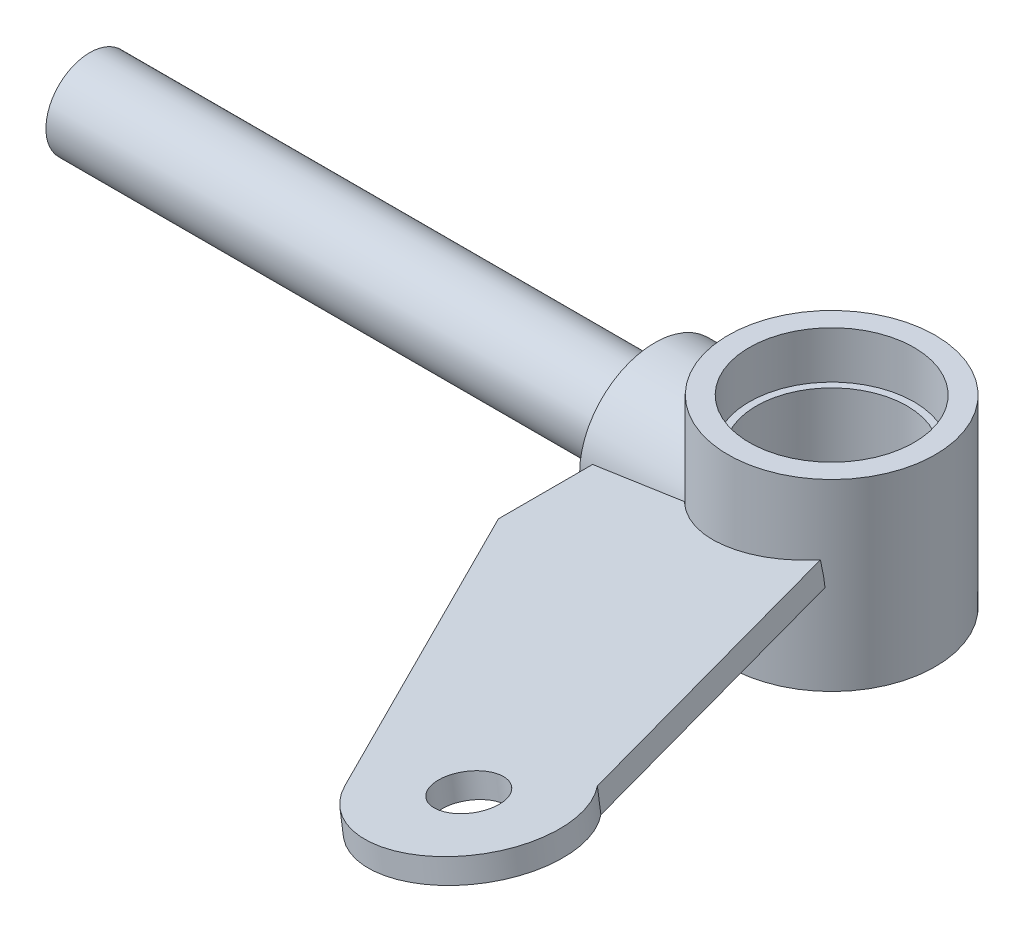
ISO-10303-21;
HEADER;
FILE_DESCRIPTION(('STEP AP214'),'2;1');
FILE_NAME('part.step','',(''),(''),'','','');
FILE_SCHEMA(('AUTOMOTIVE_DESIGN { 1 0 10303 214 1 1 1 1 }'));
ENDSEC;
DATA;
#1=APPLICATION_CONTEXT('core data for automotive mechanical design processes');
#2=APPLICATION_PROTOCOL_DEFINITION('international standard','automotive_design',2000,#1);
#3=PRODUCT_CONTEXT('',#1,'mechanical');
#4=PRODUCT('Part','Part','',(#3));
#5=PRODUCT_RELATED_PRODUCT_CATEGORY('part','',(#4));
#6=PRODUCT_DEFINITION_FORMATION('','',#4);
#7=PRODUCT_DEFINITION_CONTEXT('part definition',#1,'design');
#8=PRODUCT_DEFINITION('design','',#6,#7);
#9=PRODUCT_DEFINITION_SHAPE('','',#8);
#10=(LENGTH_UNIT() NAMED_UNIT(*) SI_UNIT(.MILLI.,.METRE.));
#11=(NAMED_UNIT(*) PLANE_ANGLE_UNIT() SI_UNIT($,.RADIAN.));
#12=(NAMED_UNIT(*) SI_UNIT($,.STERADIAN.) SOLID_ANGLE_UNIT());
#13=UNCERTAINTY_MEASURE_WITH_UNIT(LENGTH_MEASURE(1.E-05),#10,'distance_accuracy_value','');
#14=(GEOMETRIC_REPRESENTATION_CONTEXT(3) GLOBAL_UNCERTAINTY_ASSIGNED_CONTEXT((#13)) GLOBAL_UNIT_ASSIGNED_CONTEXT((#10,
#11,#12)) REPRESENTATION_CONTEXT('',''));
#15=CARTESIAN_POINT('',(0.,0.,0.));
#16=DIRECTION('',(0.,0.,1.));
#17=DIRECTION('',(1.,0.,0.));
#18=AXIS2_PLACEMENT_3D('',#15,#16,#17);
#19=CARTESIAN_POINT('',(-23.8649527829231,-3.56664109055751,0.));
#20=DIRECTION('',(1.,0.,0.));
#21=DIRECTION('',(0.,0.,-1.));
#22=AXIS2_PLACEMENT_3D('',#19,#20,#21);
#23=CYLINDRICAL_SURFACE('',#22,10.1308937353786);
#24=CARTESIAN_POINT('',(-23.8649527829231,-3.56664109055751,0.));
#25=DIRECTION('',(-1.,0.,0.));
#26=DIRECTION('',(0.,0.,1.));
#27=AXIS2_PLACEMENT_3D('',#24,#25,#26);
#28=CIRCLE('',#27,10.1308937353786);
#29=CARTESIAN_POINT('',(-23.8649527829231,-3.56664109055751,10.1308937353786));
#30=VERTEX_POINT('',#29);
#31=EDGE_CURVE('E46',#30,#30,#28,.T.);
#32=ORIENTED_EDGE('',*,*,#31,.F.);
#33=EDGE_LOOP('',(#32));
#34=FACE_BOUND('',#33,.T.);
#35=CARTESIAN_POINT('',(-9.61903800400362,-3.56664109055751,10.1308937353786));
#36=CARTESIAN_POINT('',(-9.61904039518556,-3.80639849007304,10.1308925484275));
#37=CARTESIAN_POINT('',(-9.62804826640795,-4.04617130452357,10.1223617673847));
#38=CARTESIAN_POINT('',(-9.66356299897845,-4.52332005065299,10.088460451511));
#39=CARTESIAN_POINT('',(-9.69007987684676,-4.76069453133077,10.0630802774652));
#40=CARTESIAN_POINT('',(-9.75923055949351,-5.23127763039902,9.99603045747903));
#41=CARTESIAN_POINT('',(-9.8019015506235,-5.46447532682341,9.95432321945606));
#42=CARTESIAN_POINT('',(-9.90128180737341,-5.92461065115534,9.85547651706718));
#43=CARTESIAN_POINT('',(-9.95799916585496,-6.15154458610549,9.79832815451211));
#44=CARTESIAN_POINT('',(-10.0822680357526,-6.59500296099345,9.67039785709462));
#45=CARTESIAN_POINT('',(-10.1496678308784,-6.81162484133087,9.59980439757005));
#46=CARTESIAN_POINT('',(-10.2935220507789,-7.23689009378552,9.44539414340223));
#47=CARTESIAN_POINT('',(-10.3699756105002,-7.4455342256309,9.36157861182483));
#48=CARTESIAN_POINT('',(-10.6096718629706,-8.05899105580503,9.09139352136984));
#49=CARTESIAN_POINT('',(-10.7833486402566,-8.45165774662793,8.8861885255637));
#50=CARTESIAN_POINT('',(-11.0707297974541,-9.05057278524142,8.52232525593784));
#51=CARTESIAN_POINT('',(-11.1803271124111,-9.26806242968694,8.37833864467592));
#52=CARTESIAN_POINT('',(-11.4016441573872,-9.6906947076907,8.07456910940664));
#53=CARTESIAN_POINT('',(-11.5133640558991,-9.89583635561965,7.91478492710445));
#54=CARTESIAN_POINT('',(-11.7367057479711,-10.2935623005356,7.5796609888092));
#55=CARTESIAN_POINT('',(-11.8483272309982,-10.4861301228153,7.40430150800249));
#56=CARTESIAN_POINT('',(-12.0692087650288,-10.8578860164378,7.03851926498492));
#57=CARTESIAN_POINT('',(-12.1784686367169,-11.0370730743084,6.84809536402509));
#58=CARTESIAN_POINT('',(-12.4124255960368,-11.4131649892626,6.41588768798282));
#59=CARTESIAN_POINT('',(-12.5362378994176,-11.6072125319033,6.17112054980703));
#60=CARTESIAN_POINT('',(-12.7744549755405,-11.9737930574009,5.6615641072247));
#61=CARTESIAN_POINT('',(-12.8888578281117,-12.1463216526137,5.39677073715651));
#62=CARTESIAN_POINT('',(-13.1048393114109,-12.4674846211503,4.84877997013028));
#63=CARTESIAN_POINT('',(-13.2064401679256,-12.6161605317473,4.5656157993196));
#64=CARTESIAN_POINT('',(-13.3939004205756,-12.8876020711898,3.98221905452536));
#65=CARTESIAN_POINT('',(-13.4797673764695,-13.0103801476271,3.68199476884057));
#66=CARTESIAN_POINT('',(-13.6110115594488,-13.1966336019867,3.15477503796826));
#67=CARTESIAN_POINT('',(-13.6609505125659,-13.2670334245227,2.93133323530667));
#68=CARTESIAN_POINT('',(-13.7503758553478,-13.392570600585,2.47817568608819));
#69=CARTESIAN_POINT('',(-13.7898645953643,-13.4477113861407,2.24846136312407));
#70=CARTESIAN_POINT('',(-13.8575683254481,-13.5419798008082,1.78428620306748));
#71=CARTESIAN_POINT('',(-13.885790634778,-13.581117826552,1.54982855186427));
#72=CARTESIAN_POINT('',(-13.9303943769411,-13.6428731553088,1.0776134348273));
#73=CARTESIAN_POINT('',(-13.9467753963032,-13.6654898814359,0.83985585406291));
#74=CARTESIAN_POINT('',(-13.9673520552707,-13.6938878916493,0.362262652436662));
#75=CARTESIAN_POINT('',(-13.9715198427555,-13.6996306950487,0.122423530875538));
#76=CARTESIAN_POINT('',(-13.9674958248509,-13.6940815897164,-0.356951834590658));
#77=CARTESIAN_POINT('',(-13.9593040668533,-13.682789746303,-0.596488079653567));
#78=CARTESIAN_POINT('',(-13.9307443343899,-13.6433434302408,-1.0734820401737));
#79=CARTESIAN_POINT('',(-13.9103736947184,-13.6151852665927,-1.31093928912264));
#80=CARTESIAN_POINT('',(-13.8579058877799,-13.5424266781346,-1.78199605263438));
#81=CARTESIAN_POINT('',(-13.8258087529768,-13.4978262988436,-2.01559557787515));
#82=CARTESIAN_POINT('',(-13.7516546264907,-13.3943252629383,-2.47073456285516));
#83=CARTESIAN_POINT('',(-13.7099106900111,-13.3358728600535,-2.69242764401209));
#84=CARTESIAN_POINT('',(-13.6167803089116,-13.2047397005971,-3.12956162592222));
#85=CARTESIAN_POINT('',(-13.5653904956596,-13.132053972933,-3.34500031200948));
#86=CARTESIAN_POINT('',(-13.4539013909604,-12.9732751607129,-3.76847042647945));
#87=CARTESIAN_POINT('',(-13.3938044220822,-12.8871856510606,-3.97650381179523));
#88=CARTESIAN_POINT('',(-13.2658556463471,-12.702366642786,-4.38448447000792));
#89=CARTESIAN_POINT('',(-13.1980010299463,-12.6036325631847,-4.58442877760948));
#90=CARTESIAN_POINT('',(-13.0477251760939,-12.3827907472346,-4.99711503805583));
#91=CARTESIAN_POINT('',(-12.9645227706009,-12.2593060849262,-5.20883565069022));
#92=CARTESIAN_POINT('',(-12.7912655651893,-11.9987261472283,-5.62089044097815));
#93=CARTESIAN_POINT('',(-12.7012078641698,-11.861625101942,-5.82121973456842));
#94=CARTESIAN_POINT('',(-12.5156831813874,-11.5746637198013,-6.21007304769013));
#95=CARTESIAN_POINT('',(-12.4202129330681,-11.4247956498306,-6.39858979053965));
#96=CARTESIAN_POINT('',(-12.2254037176577,-11.1131238721971,-6.76336978651223));
#97=CARTESIAN_POINT('',(-12.1260643094612,-10.9513188017592,-6.93963163609262));
#98=CARTESIAN_POINT('',(-11.9060924564752,-10.5847977195688,-7.31169885898195));
#99=CARTESIAN_POINT('',(-11.784977050915,-10.3777434401458,-7.50492223431334));
#100=CARTESIAN_POINT('',(-11.5421499086569,-9.94838845974052,-7.87326842070626));
#101=CARTESIAN_POINT('',(-11.4204380574974,-9.72608471665142,-8.04838760260167));
#102=CARTESIAN_POINT('',(-11.1793564225601,-9.26667224415712,-8.38002952893089));
#103=CARTESIAN_POINT('',(-11.059987157159,-9.02956028541537,-8.53654819525791));
#104=CARTESIAN_POINT('',(-10.8270403738253,-8.54107815226735,-8.83013329096768));
#105=CARTESIAN_POINT('',(-10.7134613267578,-8.28971177973054,-8.96720487334647));
#106=CARTESIAN_POINT('',(-10.4345578564576,-7.62721997990816,-9.29241023498748));
#107=CARTESIAN_POINT('',(-10.276013055899,-7.20568192841436,-9.46596501358648));
#108=CARTESIAN_POINT('',(-10.0690586595743,-6.55040855821285,-9.68427081004709));
#109=CARTESIAN_POINT('',(-10.0052475501124,-6.32830056588317,-9.7500073736609));
#110=CARTESIAN_POINT('',(-9.89019913814885,-5.87698619457917,-9.86668962366791));
#111=CARTESIAN_POINT('',(-9.83895932371261,-5.64778124400931,-9.91763826528416));
#112=CARTESIAN_POINT('',(-9.75837597016585,-5.22091458018934,-9.99688268890805));
#113=CARTESIAN_POINT('',(-9.72683786447325,-5.0240958262901,-10.0275019956832));
#114=CARTESIAN_POINT('',(-9.67536667327016,-4.62751365762141,-10.077175547512));
#115=CARTESIAN_POINT('',(-9.65543122849678,-4.42775084996649,-10.0962321437387));
#116=CARTESIAN_POINT('',(-9.62795797837324,-4.02671672226621,-10.1224349906279));
#117=CARTESIAN_POINT('',(-9.6204122799653,-3.82544644474953,-10.1295888241474));
#118=CARTESIAN_POINT('',(-9.61800696449502,-3.42275529878834,-10.1318727471276));
#119=CARTESIAN_POINT('',(-9.62314764588194,-3.2213344269125,-10.1270025537211));
#120=CARTESIAN_POINT('',(-9.64588409227045,-2.82015303979755,-10.1053481719863));
#121=CARTESIAN_POINT('',(-9.66346131474361,-2.62039050009428,-10.0885817205352));
#122=CARTESIAN_POINT('',(-9.7103475014837,-2.22359057700764,-10.0434606985891));
#123=CARTESIAN_POINT('',(-9.73965643283577,-2.02655318598011,-10.0151061606061));
#124=CARTESIAN_POINT('',(-9.80896813642319,-1.6361160617716,-9.94723031172033));
#125=CARTESIAN_POINT('',(-9.84898244301011,-1.44272049442085,-9.90769695372883));
#126=CARTESIAN_POINT('',(-9.93840382129691,-1.06054152358299,-9.81799555196965));
#127=CARTESIAN_POINT('',(-9.987816225101,-0.871760807328803,-9.76782146921264));
#128=CARTESIAN_POINT('',(-10.116329852951,-0.423853421042503,-9.63495869026011));
#129=CARTESIAN_POINT('',(-10.1993379012841,-0.167299199204759,-9.54734104960247));
#130=CARTESIAN_POINT('',(-10.3772942193556,0.334306117510249,-9.35360629636579));
#131=CARTESIAN_POINT('',(-10.4722424118898,0.5793572867514,-9.24748930340058));
#132=CARTESIAN_POINT('',(-10.6707826742691,1.05799001089977,-9.01767125631354));
#133=CARTESIAN_POINT('',(-10.7743900143872,1.2915500983756,-8.89393885548554));
#134=CARTESIAN_POINT('',(-10.9870097338924,1.74644839226086,-8.6299043590512));
#135=CARTESIAN_POINT('',(-11.0960215550136,1.96778785605096,-8.48960397280577));
#136=CARTESIAN_POINT('',(-11.3200061370829,2.40435294955986,-8.18868526639421));
#137=CARTESIAN_POINT('',(-11.4350599663479,2.61920935204989,-8.02759203023276));
#138=CARTESIAN_POINT('',(-11.6654520160729,3.03539669583716,-7.68895804136308));
#139=CARTESIAN_POINT('',(-11.7807902494431,3.23672701096218,-7.51141652810762));
#140=CARTESIAN_POINT('',(-12.0092582989231,3.62509143227999,-7.14044990952776));
#141=CARTESIAN_POINT('',(-12.1223902014477,3.81213958654222,-6.9470408106314));
#142=CARTESIAN_POINT('',(-12.3443764724911,4.17142654750338,-6.54447239318099));
#143=CARTESIAN_POINT('',(-12.4532294070762,4.34366041234396,-6.33530786212548));
#144=CARTESIAN_POINT('',(-12.6592105315339,4.66403356177297,-5.91251250663103));
#145=CARTESIAN_POINT('',(-12.756652573291,4.81294498034245,-5.69962055304822));
#146=CARTESIAN_POINT('',(-12.9438341974239,5.09523556233258,-5.26069786253675));
#147=CARTESIAN_POINT('',(-13.0335775948145,5.2286224306741,-5.03467372741163));
#148=CARTESIAN_POINT('',(-13.203639574756,5.47872307569743,-4.5701185779084));
#149=CARTESIAN_POINT('',(-13.2839569590916,5.59543473306986,-4.33158597904411));
#150=CARTESIAN_POINT('',(-13.4334147586671,5.81081876001885,-3.84310964191962));
#151=CARTESIAN_POINT('',(-13.5025552563403,5.90949126264096,-3.59316598783722));
#152=CARTESIAN_POINT('',(-13.6285500984672,6.0881781687157,-3.08116744840382));
#153=CARTESIAN_POINT('',(-13.685296248588,6.16802871246312,-2.8190283988032));
#154=CARTESIAN_POINT('',(-13.7842662640073,6.30667972615402,-2.28653086208386));
#155=CARTESIAN_POINT('',(-13.8264899456796,6.36547992993113,-2.01617227108185));
#156=CARTESIAN_POINT('',(-13.8951876887182,6.46089325607901,-1.46982675384622));
#157=CARTESIAN_POINT('',(-13.92167543574,6.49752565846372,-1.19384493490776));
#158=CARTESIAN_POINT('',(-13.9581604686139,6.54793547020552,-0.638735201978681));
#159=CARTESIAN_POINT('',(-13.9681603176359,6.56171643199589,-0.359607783789694));
#160=CARTESIAN_POINT('',(-13.9711500360893,6.56583795252878,0.159413192084087));
#161=CARTESIAN_POINT('',(-13.9663437645275,6.55921549763676,0.399277514995647));
#162=CARTESIAN_POINT('',(-13.9444750988441,6.52903147048661,0.877354922388121));
#163=CARTESIAN_POINT('',(-13.9274140752457,6.50547179242046,1.11556818850916));
#164=CARTESIAN_POINT('',(-13.8814170008217,6.44177184925209,1.58859789337555));
#165=CARTESIAN_POINT('',(-13.8524806813183,6.40163120900632,1.82341425514167));
#166=CARTESIAN_POINT('',(-13.7833558826398,6.30534603610142,2.28804988925621));
#167=CARTESIAN_POINT('',(-13.7431670481229,6.24920099804036,2.51786900355014));
#168=CARTESIAN_POINT('',(-13.653222476376,6.12286458200034,2.96678777092026));
#169=CARTESIAN_POINT('',(-13.6036632807597,6.05296073537101,3.18600817588901));
#170=CARTESIAN_POINT('',(-13.4953977759985,5.89923694826681,3.61726235028896));
#171=CARTESIAN_POINT('',(-13.4366882895127,5.81541217323288,3.82929359210396));
#172=CARTESIAN_POINT('',(-13.3111546937625,5.63472663802529,4.24514110928424));
#173=CARTESIAN_POINT('',(-13.2443330727005,5.53786987411879,4.44895987820896));
#174=CARTESIAN_POINT('',(-13.1035931875214,5.33189351278721,4.84783428956793));
#175=CARTESIAN_POINT('',(-13.0296723876691,5.22276953127871,5.0428867640026));
#176=CARTESIAN_POINT('',(-12.8655887953336,4.97776246672566,5.44900506020993));
#177=CARTESIAN_POINT('',(-12.774573934779,4.84025107136051,5.65874481038786));
#178=CARTESIAN_POINT('',(-12.5864152819499,4.55148431377991,6.06575202179333));
#179=CARTESIAN_POINT('',(-12.4892688484989,4.40022301627013,6.26301403396537));
#180=CARTESIAN_POINT('',(-12.2903857682433,4.08468018068767,6.64482533350065));
#181=CARTESIAN_POINT('',(-12.1886436622751,3.92038297231731,6.82935880653214));
#182=CARTESIAN_POINT('',(-11.9823876861637,3.57969358465794,7.18509243328137));
#183=CARTESIAN_POINT('',(-11.8778745980929,3.40330479623322,7.35629629651572));
#184=CARTESIAN_POINT('',(-11.647935575154,3.00449779613303,7.71623517005945));
#185=CARTESIAN_POINT('',(-11.5222871992665,2.77967722820198,7.90217618090308));
#186=CARTESIAN_POINT('',(-11.2726129564929,2.31421952225714,8.25443630149153));
#187=CARTESIAN_POINT('',(-11.1485875112876,2.07357836777106,8.42075039824053));
#188=CARTESIAN_POINT('',(-10.9057722570196,1.57697996999549,8.73293186636326));
#189=CARTESIAN_POINT('',(-10.7869801360365,1.32102961008681,8.87880832982476));
#190=CARTESIAN_POINT('',(-10.5587418575411,0.794270740970725,9.14905212486612));
#191=CARTESIAN_POINT('',(-10.4492914539145,0.523469075096433,9.27342925523371));
#192=CARTESIAN_POINT('',(-10.2020195511406,-0.147807927528755,9.54599963851673));
#193=CARTESIAN_POINT('',(-10.0711059209067,-0.555714314304154,9.68286968729264));
#194=CARTESIAN_POINT('',(-9.90733587456377,-1.18537456282063,9.84945002462021));
#195=CARTESIAN_POINT('',(-9.85821569931913,-1.39798272775063,9.89848970747908));
#196=CARTESIAN_POINT('',(-9.77257407853592,-1.82833914504426,9.98305180029197));
#197=CARTESIAN_POINT('',(-9.73604673290652,-2.04608493905188,10.0185805413043));
#198=CARTESIAN_POINT('',(-9.67788393172438,-2.48006028989114,10.0747739941289));
#199=CARTESIAN_POINT('',(-9.65591215394802,-2.69620084434266,10.0957749346338));
#200=CARTESIAN_POINT('',(-9.62648626113937,-3.13043672258906,10.1238371131521));
#201=CARTESIAN_POINT('',(-9.61903582873288,-3.34853252815357,10.1308948151543));
#202=CARTESIAN_POINT('',(-9.61903800400362,-3.56664109055751,10.1308937353786));
#203=B_SPLINE_CURVE_WITH_KNOTS('',3,(#35,#36,#37,#38,#39,#40,#41,#42,#43,#44,#45,#46,#47,#48,
#49,#50,#51,#52,#53,#54,#55,#56,#57,#58,#59,#60,#61,#62,#63,#64,#65,#66,#67,#68,#69,#70,#71,#72,
#73,#74,#75,#76,#77,#78,#79,#80,#81,#82,#83,#84,#85,#86,#87,#88,#89,#90,#91,#92,#93,#94,#95,#96,
#97,#98,#99,#100,#101,#102,#103,#104,#105,#106,#107,#108,#109,#110,#111,#112,#113,#114,#115,
#116,#117,#118,#119,#120,#121,#122,#123,#124,#125,#126,#127,#128,#129,#130,#131,#132,#133,#134,
#135,#136,#137,#138,#139,#140,#141,#142,#143,#144,#145,#146,#147,#148,#149,#150,#151,#152,#153,
#154,#155,#156,#157,#158,#159,#160,#161,#162,#163,#164,#165,#166,#167,#168,#169,#170,#171,#172,
#173,#174,#175,#176,#177,#178,#179,#180,#181,#182,#183,#184,#185,#186,#187,#188,#189,#190,#191,
#192,#193,#194,#195,#196,#197,#198,#199,#200,#201,#202),.UNSPECIFIED.,.T.,.F.,(4,2,2,2,2,2,2,2,
2,2,2,2,2,2,2,2,2,2,2,2,2,2,2,2,2,2,2,2,2,2,2,2,2,2,2,2,2,2,2,2,2,2,2,2,2,2,2,2,2,2,2,2,2,2,2,2,
2,2,2,2,2,2,2,2,2,2,2,2,2,2,2,2,2,2,2,2,2,2,2,2,2,2,2,4),(0.,0.718986430556499,1.43838453432068,
2.15944884422623,2.88092956821217,3.59295563755625,4.30491373027604,5.72776731350085,
6.57598137740762,7.42426305706003,8.27363476416962,9.12307073841017,10.1296948523243,
11.1365238792831,12.1415801146481,13.1461521712457,13.8640302461093,14.5817467259189,
15.2989961777896,16.0162706731741,16.7351796358586,17.4540858419387,18.1731494298417,
18.8922110270861,19.5905886992465,20.2892107213434,20.9876467331289,21.6863364996942,
22.4621002275026,23.2381940966427,24.0147614424422,24.7914175818404,25.714522601662,
26.6378123097394,27.5613040742839,28.4845506775028,29.9265069423248,30.6465965896972,
31.3665422348896,31.9709148179918,32.5751644661552,33.1790290192293,33.782907778455,
34.3858880638182,34.9888666574522,35.5924975564188,36.1964719585592,37.0457694927818,
37.8950615357868,38.7458842406101,39.5966192404727,40.4722840821963,41.3479894337663,
42.2228220302062,43.0979453368963,43.9295666705423,44.7607734897943,45.5920858561592,
46.4233920910355,47.2616882272785,48.0999949627971,48.9375715455123,49.7750179082545,
50.4941329360237,51.213167553324,51.9322184396432,52.6512920353434,53.3566862334085,
54.0623259200509,54.7677497129391,55.4734264179514,56.2730674837934,57.0730553775135,
57.8740199357032,58.6747607895957,59.6267026398152,60.5788871058234,61.5306466193494,
62.4819711974511,63.8255216151532,64.4958132474092,65.1657904012277,65.8196903157807,
66.4737560383548),.UNSPECIFIED.);
#204=CARTESIAN_POINT('',(-9.61903800400362,-3.56664109055751,10.1308937353786));
#205=VERTEX_POINT('',#204);
#206=EDGE_CURVE('E54',#205,#205,#203,.T.);
#207=ORIENTED_EDGE('',*,*,#206,.F.);
#208=EDGE_LOOP('',(#207));
#209=FACE_BOUND('',#208,.T.);
#210=ADVANCED_FACE('F43',(#34,#209),#23,.T.);
#211=CARTESIAN_POINT('',(-23.8649527829231,-3.56664109055751,0.));
#212=DIRECTION('',(-1.,0.,0.));
#213=DIRECTION('',(0.,0.,1.));
#214=AXIS2_PLACEMENT_3D('',#211,#212,#213);
#215=PLANE('',#214);
#216=CARTESIAN_POINT('',(-23.8649527829231,-3.56664109055751,0.));
#217=DIRECTION('',(-1.,0.,0.));
#218=DIRECTION('',(0.,0.,1.));
#219=AXIS2_PLACEMENT_3D('',#216,#217,#218);
#220=CIRCLE('',#219,5.92106637307848);
#221=CARTESIAN_POINT('',(-23.8649527829231,-3.56664109055751,-5.92106637307848));
#222=VERTEX_POINT('',#221);
#223=EDGE_CURVE('E11',#222,#222,#220,.T.);
#224=ORIENTED_EDGE('',*,*,#223,.F.);
#225=EDGE_LOOP('',(#224));
#226=FACE_BOUND('',#225,.T.);
#227=ORIENTED_EDGE('',*,*,#31,.T.);
#228=EDGE_LOOP('',(#227));
#229=FACE_BOUND('',#228,.T.);
#230=ADVANCED_FACE('F69',(#226,#229),#215,.T.);
#231=CARTESIAN_POINT('',(0.,-12.3825,0.));
#232=DIRECTION('',(0.,-1.,0.));
#233=DIRECTION('',(0.,0.,-1.));
#234=AXIS2_PLACEMENT_3D('',#231,#232,#233);
#235=CYLINDRICAL_SURFACE('',#234,13.97);
#236=ORIENTED_EDGE('',*,*,#206,.T.);
#237=EDGE_LOOP('',(#236));
#238=FACE_BOUND('',#237,.T.);
#239=ADVANCED_FACE('F65',(#238),#235,.F.);
#240=CARTESIAN_POINT('',(-100.064952782923,-3.56664109055751,0.));
#241=DIRECTION('',(1.,0.,0.));
#242=DIRECTION('',(0.,0.,-1.));
#243=AXIS2_PLACEMENT_3D('',#240,#241,#242);
#244=CYLINDRICAL_SURFACE('',#243,5.92106637307848);
#245=CARTESIAN_POINT('',(-100.064952782923,-3.56664109055751,0.));
#246=DIRECTION('',(-1.,0.,0.));
#247=DIRECTION('',(0.,0.,1.));
#248=AXIS2_PLACEMENT_3D('',#245,#246,#247);
#249=CIRCLE('',#248,5.92106637307848);
#250=CARTESIAN_POINT('',(-100.064952782923,-3.56664109055751,-5.92106637307847));
#251=VERTEX_POINT('',#250);
#252=EDGE_CURVE('E56',#251,#251,#249,.T.);
#253=CARTESIAN_POINT('',(-100.064952782923,-3.56664109055751,-5.92106637307847));
#254=CARTESIAN_POINT('',(-99.2712027829231,-3.56664109055751,-5.92106637307847));
#255=CARTESIAN_POINT('',(-98.4774527829231,-3.56664109055751,-5.92106637307847));
#256=CARTESIAN_POINT('',(-96.8899527829231,-3.56664109055751,-5.92106637307847));
#257=CARTESIAN_POINT('',(-96.0962027829231,-3.56664109055751,-5.92106637307847));
#258=CARTESIAN_POINT('',(-94.5087027829231,-3.56664109055751,-5.92106637307847));
#259=CARTESIAN_POINT('',(-93.7149527829231,-3.56664109055751,-5.92106637307847));
#260=CARTESIAN_POINT('',(-92.1274527829231,-3.56664109055751,-5.92106637307847));
#261=CARTESIAN_POINT('',(-91.3337027829231,-3.56664109055751,-5.92106637307848));
#262=CARTESIAN_POINT('',(-89.7462027829231,-3.56664109055751,-5.92106637307848));
#263=CARTESIAN_POINT('',(-88.9524527829231,-3.56664109055751,-5.92106637307848));
#264=CARTESIAN_POINT('',(-87.3649527829231,-3.56664109055751,-5.92106637307848));
#265=CARTESIAN_POINT('',(-86.5712027829231,-3.56664109055751,-5.92106637307848));
#266=CARTESIAN_POINT('',(-84.9837027829231,-3.56664109055751,-5.92106637307848));
#267=CARTESIAN_POINT('',(-84.1899527829231,-3.56664109055751,-5.92106637307848));
#268=CARTESIAN_POINT('',(-82.6024527829231,-3.56664109055751,-5.92106637307848));
#269=CARTESIAN_POINT('',(-81.8087027829231,-3.56664109055751,-5.92106637307848));
#270=CARTESIAN_POINT('',(-80.2212027829231,-3.56664109055751,-5.92106637307848));
#271=CARTESIAN_POINT('',(-79.4274527829231,-3.56664109055751,-5.92106637307848));
#272=CARTESIAN_POINT('',(-77.8399527829231,-3.56664109055751,-5.92106637307848));
#273=CARTESIAN_POINT('',(-77.0462027829231,-3.56664109055751,-5.92106637307848));
#274=CARTESIAN_POINT('',(-75.4587027829231,-3.56664109055751,-5.92106637307848));
#275=CARTESIAN_POINT('',(-74.6649527829231,-3.56664109055751,-5.92106637307848));
#276=CARTESIAN_POINT('',(-73.0774527829231,-3.56664109055751,-5.92106637307848));
#277=CARTESIAN_POINT('',(-72.2837027829231,-3.56664109055751,-5.92106637307848));
#278=CARTESIAN_POINT('',(-70.6962027829231,-3.56664109055751,-5.92106637307848));
#279=CARTESIAN_POINT('',(-69.902452782923,-3.56664109055751,-5.92106637307848));
#280=CARTESIAN_POINT('',(-68.3149527829231,-3.56664109055751,-5.92106637307848));
#281=CARTESIAN_POINT('',(-67.5212027829231,-3.56664109055751,-5.92106637307848));
#282=CARTESIAN_POINT('',(-65.9337027829231,-3.56664109055751,-5.92106637307848));
#283=CARTESIAN_POINT('',(-65.1399527829231,-3.56664109055751,-5.92106637307848));
#284=CARTESIAN_POINT('',(-63.5524527829231,-3.56664109055751,-5.92106637307848));
#285=CARTESIAN_POINT('',(-62.7587027829231,-3.56664109055751,-5.92106637307848));
#286=CARTESIAN_POINT('',(-61.1712027829231,-3.56664109055751,-5.92106637307848));
#287=CARTESIAN_POINT('',(-60.3774527829231,-3.56664109055751,-5.92106637307848));
#288=CARTESIAN_POINT('',(-58.7899527829231,-3.56664109055751,-5.92106637307848));
#289=CARTESIAN_POINT('',(-57.9962027829231,-3.56664109055751,-5.92106637307848));
#290=CARTESIAN_POINT('',(-56.4087027829231,-3.56664109055751,-5.92106637307848));
#291=CARTESIAN_POINT('',(-55.6149527829231,-3.56664109055751,-5.92106637307848));
#292=CARTESIAN_POINT('',(-54.0274527829231,-3.56664109055751,-5.92106637307848));
#293=CARTESIAN_POINT('',(-53.2337027829231,-3.56664109055751,-5.92106637307848));
#294=CARTESIAN_POINT('',(-51.6462027829231,-3.56664109055751,-5.92106637307848));
#295=CARTESIAN_POINT('',(-50.8524527829231,-3.56664109055751,-5.92106637307848));
#296=CARTESIAN_POINT('',(-49.2649527829231,-3.56664109055751,-5.92106637307848));
#297=CARTESIAN_POINT('',(-48.4712027829231,-3.56664109055751,-5.92106637307848));
#298=CARTESIAN_POINT('',(-46.8837027829231,-3.56664109055751,-5.92106637307848));
#299=CARTESIAN_POINT('',(-46.0899527829231,-3.56664109055751,-5.92106637307848));
#300=CARTESIAN_POINT('',(-44.5024527829231,-3.56664109055751,-5.92106637307848));
#301=CARTESIAN_POINT('',(-43.7087027829231,-3.56664109055751,-5.92106637307848));
#302=CARTESIAN_POINT('',(-42.1212027829231,-3.56664109055751,-5.92106637307848));
#303=CARTESIAN_POINT('',(-41.3274527829231,-3.56664109055751,-5.92106637307848));
#304=CARTESIAN_POINT('',(-39.7399527829231,-3.56664109055751,-5.92106637307848));
#305=CARTESIAN_POINT('',(-38.9462027829231,-3.56664109055751,-5.92106637307848));
#306=CARTESIAN_POINT('',(-37.3587027829231,-3.56664109055751,-5.92106637307848));
#307=CARTESIAN_POINT('',(-36.5649527829231,-3.56664109055751,-5.92106637307848));
#308=CARTESIAN_POINT('',(-34.9774527829231,-3.56664109055751,-5.92106637307848));
#309=CARTESIAN_POINT('',(-34.1837027829231,-3.56664109055751,-5.92106637307848));
#310=CARTESIAN_POINT('',(-32.5962027829231,-3.56664109055751,-5.92106637307848));
#311=CARTESIAN_POINT('',(-31.8024527829231,-3.56664109055751,-5.92106637307848));
#312=CARTESIAN_POINT('',(-30.2149527829231,-3.56664109055751,-5.92106637307848));
#313=CARTESIAN_POINT('',(-29.4212027829231,-3.56664109055751,-5.92106637307848));
#314=CARTESIAN_POINT('',(-27.8337027829231,-3.56664109055751,-5.92106637307848));
#315=CARTESIAN_POINT('',(-27.0399527829231,-3.56664109055751,-5.92106637307848));
#316=CARTESIAN_POINT('',(-25.4524527829231,-3.56664109055751,-5.92106637307848));
#317=CARTESIAN_POINT('',(-24.6587027829231,-3.56664109055751,-5.92106637307848));
#318=CARTESIAN_POINT('',(-23.8649527829231,-3.56664109055751,-5.92106637307848));
#319=B_SPLINE_CURVE_WITH_KNOTS('',3,(#253,#254,#255,#256,#257,#258,#259,#260,#261,#262,#263,
#264,#265,#266,#267,#268,#269,#270,#271,#272,#273,#274,#275,#276,#277,#278,#279,#280,#281,#282,
#283,#284,#285,#286,#287,#288,#289,#290,#291,#292,#293,#294,#295,#296,#297,#298,#299,#300,#301,
#302,#303,#304,#305,#306,#307,#308,#309,#310,#311,#312,#313,#314,#315,#316,#317,#318),
.UNSPECIFIED.,.F.,.F.,(4,2,2,2,2,2,2,2,2,2,2,2,2,2,2,2,2,2,2,2,2,2,2,2,2,2,2,2,2,2,2,2,4),(0.,
2.38124999999999,4.76249999999999,7.14374999999999,9.52499999999999,11.90625,14.2875,16.66875,
19.05,21.43125,23.8125,26.19375,28.575,30.95625,33.3375,35.71875,38.1,40.48125,42.8625,45.24375,
47.625,50.00625,52.3875,54.76875,57.15,59.53125,61.9125,64.29375,66.675,69.05625,71.4375,
73.81875,76.2),.UNSPECIFIED.);
#320=EDGE_CURVE('BSEAM68',#251,#222,#319,.T.);
#321=ORIENTED_EDGE('',*,*,#252,.F.);
#322=ORIENTED_EDGE('',*,*,#223,.T.);
#323=ORIENTED_EDGE('',*,*,#320,.T.);
#324=ORIENTED_EDGE('',*,*,#320,.F.);
#325=EDGE_LOOP('',(#321,#323,#322,#324));
#326=FACE_BOUND('',#325,.T.);
#327=ADVANCED_FACE('F68',(#326),#244,.T.);
#328=CARTESIAN_POINT('',(-100.064952782923,-3.56664109055751,0.));
#329=DIRECTION('',(-1.,0.,0.));
#330=DIRECTION('',(0.,0.,1.));
#331=AXIS2_PLACEMENT_3D('',#328,#329,#330);
#332=PLANE('',#331);
#333=ORIENTED_EDGE('',*,*,#252,.T.);
#334=EDGE_LOOP('',(#333));
#335=FACE_BOUND('',#334,.T.);
#336=ADVANCED_FACE('F103',(#335),#332,.T.);
#337=CLOSED_SHELL('',(#210,#230,#239,#327,#336));
#338=MANIFOLD_SOLID_BREP('B2',#337);
#339=CARTESIAN_POINT('',(0.234647440168257,-1.57006268308705,0.));
#340=DIRECTION('',(-0.147809411129611,0.989015863361917,0.));
#341=DIRECTION('',(-0.989015863361917,-0.147809411129611,0.));
#342=AXIS2_PLACEMENT_3D('',#339,#340,#341);
#343=CYLINDRICAL_SURFACE('',#342,13.97);
#344=DIRECTION('',(-0.147809411129611,0.989015863361917,0.));
#345=VECTOR('',#344,1.);
#346=CARTESIAN_POINT('',(-9.24832320807506,-2.9873021422314,10.16));
#347=LINE('',#346,#345);
#348=CARTESIAN_POINT('',(-9.24832320807506,-2.9873021422314,10.16));
#349=VERTEX_POINT('',#348);
#350=CARTESIAN_POINT('',(-9.71761808841157,0.152823223942687,10.16));
#351=VERTEX_POINT('',#350);
#352=EDGE_CURVE('E132',#349,#351,#347,.T.);
#353=ORIENTED_EDGE('',*,*,#352,.T.);
#354=CARTESIAN_POINT('',(-0.234647440168257,1.57006268308704,0.));
#355=DIRECTION('',(-0.147809411129611,0.989015863361917,0.));
#356=DIRECTION('',(-0.989015863361917,-0.147809411129611,0.));
#357=AXIS2_PLACEMENT_3D('',#354,#355,#356);
#358=CIRCLE('',#357,13.97);
#359=CARTESIAN_POINT('',(9.00909998125439,2.95154999143708,10.382944015346));
#360=VERTEX_POINT('',#359);
#361=EDGE_CURVE('E183',#351,#360,#358,.T.);
#362=ORIENTED_EDGE('',*,*,#361,.T.);
#363=DIRECTION('',(-0.147809411129611,0.989015863361917,0.));
#364=VECTOR('',#363,1.);
#365=CARTESIAN_POINT('',(9.47839486159091,-0.188575374737006,10.382944015346));
#366=LINE('',#365,#364);
#367=CARTESIAN_POINT('',(9.47839486159091,-0.188575374737006,10.382944015346));
#368=VERTEX_POINT('',#367);
#369=EDGE_CURVE('E41',#368,#360,#366,.T.);
#370=ORIENTED_EDGE('',*,*,#369,.F.);
#371=CARTESIAN_POINT('',(0.234647440168257,-1.57006268308705,0.));
#372=DIRECTION('',(-0.147809411129611,0.989015863361917,0.));
#373=DIRECTION('',(-0.989015863361917,-0.147809411129611,0.));
#374=AXIS2_PLACEMENT_3D('',#371,#372,#373);
#375=CIRCLE('',#374,13.97);
#376=EDGE_CURVE('E185',#349,#368,#375,.T.);
#377=ORIENTED_EDGE('',*,*,#376,.F.);
#378=EDGE_LOOP('',(#353,#362,#370,#377));
#379=FACE_BOUND('',#378,.T.);
#380=ADVANCED_FACE('F129',(#379),#343,.F.);
#381=CARTESIAN_POINT('',(5.75075478009399,-0.745674917585867,-1.73476149026003));
#382=DIRECTION('',(-0.944388682248357,-0.1411398342248,0.297000949554388));
#383=DIRECTION('',(0.300004089416815,0.,0.953937915345222));
#384=AXIS2_PLACEMENT_3D('',#381,#382,#383);
#385=PLANE('',#384);
#386=ORIENTED_EDGE('',*,*,#369,.T.);
#387=DIRECTION('',(0.293738650542842,0.0438995354585693,0.95487718370678));
#388=VECTOR('',#387,1.);
#389=CARTESIAN_POINT('',(5.28145989975747,2.39445044858822,-1.73476149026003));
#390=LINE('',#389,#388);
#391=CARTESIAN_POINT('',(22.4388310840731,4.95863675260287,54.03992885442));
#392=VERTEX_POINT('',#391);
#393=EDGE_CURVE('E199',#360,#392,#390,.T.);
#394=ORIENTED_EDGE('',*,*,#393,.T.);
#395=DIRECTION('',(-0.147809411129611,0.989015863361917,0.));
#396=VECTOR('',#395,1.);
#397=CARTESIAN_POINT('',(22.9081259644096,1.81851138642878,54.03992885442));
#398=LINE('',#397,#396);
#399=CARTESIAN_POINT('',(22.9081259644096,1.81851138642878,54.03992885442));
#400=VERTEX_POINT('',#399);
#401=EDGE_CURVE('E137',#400,#392,#398,.T.);
#402=ORIENTED_EDGE('',*,*,#401,.F.);
#403=DIRECTION('',(0.293738650542842,0.0438995354585693,0.95487718370678));
#404=VECTOR('',#403,1.);
#405=CARTESIAN_POINT('',(5.75075478009399,-0.745674917585867,-1.73476149026003));
#406=LINE('',#405,#404);
#407=EDGE_CURVE('E144',#368,#400,#406,.T.);
#408=ORIENTED_EDGE('',*,*,#407,.F.);
#409=EDGE_LOOP('',(#386,#394,#402,#408));
#410=FACE_BOUND('',#409,.T.);
#411=ADVANCED_FACE('F247',(#410),#385,.F.);
#412=CARTESIAN_POINT('',(13.5706498734737,0.423016234564858,62.0518224996404));
#413=DIRECTION('',(-0.147809411129611,0.989015863361917,0.));
#414=DIRECTION('',(-0.989015863361917,-0.147809411129611,0.));
#415=AXIS2_PLACEMENT_3D('',#412,#413,#414);
#416=CYLINDRICAL_SURFACE('',#415,12.3825);
#417=ORIENTED_EDGE('',*,*,#401,.T.);
#418=CARTESIAN_POINT('',(13.1013549931372,3.56314160073894,62.0518224996404));
#419=DIRECTION('',(-0.147809411129611,0.989015863361917,0.));
#420=DIRECTION('',(-0.989015863361917,-0.147809411129611,0.));
#421=AXIS2_PLACEMENT_3D('',#418,#419,#420);
#422=CIRCLE('',#421,12.3825);
#423=CARTESIAN_POINT('',(2.36023771189573,1.95787086744899,67.9997474885302));
#424=VERTEX_POINT('',#423);
#425=EDGE_CURVE('E210',#424,#392,#422,.T.);
#426=ORIENTED_EDGE('',*,*,#425,.F.);
#427=DIRECTION('',(-0.147809411129611,0.989015863361917,0.));
#428=VECTOR('',#427,1.);
#429=CARTESIAN_POINT('',(2.82953259223224,-1.1822544987251,67.9997474885302));
#430=LINE('',#429,#428);
#431=CARTESIAN_POINT('',(2.82953259223224,-1.1822544987251,67.9997474885302));
#432=VERTEX_POINT('',#431);
#433=EDGE_CURVE('E232',#432,#424,#430,.T.);
#434=ORIENTED_EDGE('',*,*,#433,.F.);
#435=CARTESIAN_POINT('',(13.5706498734737,0.423016234564858,62.0518224996404));
#436=DIRECTION('',(-0.147809411129611,0.989015863361917,0.));
#437=DIRECTION('',(-0.989015863361917,-0.147809411129611,0.));
#438=AXIS2_PLACEMENT_3D('',#435,#436,#437);
#439=CIRCLE('',#438,12.3825);
#440=EDGE_CURVE('E225',#432,#400,#439,.T.);
#441=ORIENTED_EDGE('',*,*,#440,.T.);
#442=EDGE_LOOP('',(#417,#426,#434,#441));
#443=FACE_BOUND('',#442,.T.);
#444=ADVANCED_FACE('F244',(#443),#416,.T.);
#445=CARTESIAN_POINT('',(-26.1030479065553,-5.50625762588314,14.5845755335089));
#446=DIRECTION('',(-0.867443349989213,-0.12964027726953,0.480349282365418));
#447=DIRECTION('',(0.484437405220755,0.,0.874825925783514));
#448=AXIS2_PLACEMENT_3D('',#445,#446,#447);
#449=PLANE('',#448);
#450=ORIENTED_EDGE('',*,*,#433,.T.);
#451=DIRECTION('',(0.475073060213911,0.0710001445629636,0.877077286749023));
#452=VECTOR('',#451,1.);
#453=CARTESIAN_POINT('',(-26.5723427868918,-2.36613225970906,14.5845755335089));
#454=LINE('',#453,#452);
#455=CARTESIAN_POINT('',(-22.0899199887399,-1.6962296840551,22.86));
#456=VERTEX_POINT('',#455);
#457=EDGE_CURVE('E205',#456,#424,#454,.T.);
#458=ORIENTED_EDGE('',*,*,#457,.F.);
#459=DIRECTION('',(-0.147809411129611,0.989015863361917,0.));
#460=VECTOR('',#459,1.);
#461=CARTESIAN_POINT('',(-21.6206251084034,-4.83635505022919,22.86));
#462=LINE('',#461,#460);
#463=CARTESIAN_POINT('',(-21.6206251084034,-4.83635505022919,22.86));
#464=VERTEX_POINT('',#463);
#465=EDGE_CURVE('E234',#464,#456,#462,.T.);
#466=ORIENTED_EDGE('',*,*,#465,.F.);
#467=DIRECTION('',(0.475073060213911,0.0710001445629636,0.877077286749023));
#468=VECTOR('',#467,1.);
#469=CARTESIAN_POINT('',(-26.1030479065553,-5.50625762588314,14.5845755335089));
#470=LINE('',#469,#468);
#471=EDGE_CURVE('E222',#464,#432,#470,.T.);
#472=ORIENTED_EDGE('',*,*,#471,.T.);
#473=EDGE_LOOP('',(#450,#458,#466,#472));
#474=FACE_BOUND('',#473,.T.);
#475=ADVANCED_FACE('F242',(#474),#449,.T.);
#476=CARTESIAN_POINT('',(-21.6206251084034,-4.83635505022919,0.));
#477=DIRECTION('',(-0.989015863361917,-0.147809411129611,0.));
#478=DIRECTION('',(0.147809411129611,-0.989015863361917,0.));
#479=AXIS2_PLACEMENT_3D('',#476,#477,#478);
#480=PLANE('',#479);
#481=ORIENTED_EDGE('',*,*,#465,.T.);
#482=DIRECTION('',(0.,0.,1.));
#483=VECTOR('',#482,1.);
#484=CARTESIAN_POINT('',(-22.0899199887399,-1.6962296840551,0.));
#485=LINE('',#484,#483);
#486=CARTESIAN_POINT('',(-22.0899199887399,-1.6962296840551,10.16));
#487=VERTEX_POINT('',#486);
#488=EDGE_CURVE('E203',#487,#456,#485,.T.);
#489=ORIENTED_EDGE('',*,*,#488,.F.);
#490=DIRECTION('',(-0.147809411129611,0.989015863361917,0.));
#491=VECTOR('',#490,1.);
#492=CARTESIAN_POINT('',(-21.6206251084034,-4.83635505022919,10.16));
#493=LINE('',#492,#491);
#494=CARTESIAN_POINT('',(-21.6206251084034,-4.83635505022919,10.16));
#495=VERTEX_POINT('',#494);
#496=EDGE_CURVE('E189',#495,#487,#493,.T.);
#497=ORIENTED_EDGE('',*,*,#496,.F.);
#498=DIRECTION('',(0.,0.,1.));
#499=VECTOR('',#498,1.);
#500=CARTESIAN_POINT('',(-21.6206251084034,-4.83635505022919,0.));
#501=LINE('',#500,#499);
#502=EDGE_CURVE('E219',#495,#464,#501,.T.);
#503=ORIENTED_EDGE('',*,*,#502,.T.);
#504=EDGE_LOOP('',(#481,#489,#497,#503));
#505=FACE_BOUND('',#504,.T.);
#506=ADVANCED_FACE('F236',(#505),#480,.T.);
#507=CARTESIAN_POINT('',(0.234647440168259,-1.57006268308704,10.16));
#508=DIRECTION('',(0.,0.,1.));
#509=DIRECTION('',(1.,0.,0.));
#510=AXIS2_PLACEMENT_3D('',#507,#508,#509);
#511=PLANE('',#510);
#512=ORIENTED_EDGE('',*,*,#496,.T.);
#513=DIRECTION('',(0.989015863361917,0.147809411129611,0.));
#514=VECTOR('',#513,1.);
#515=CARTESIAN_POINT('',(-0.234647440168256,1.57006268308704,10.16));
#516=LINE('',#515,#514);
#517=EDGE_CURVE('E196',#487,#351,#516,.T.);
#518=ORIENTED_EDGE('',*,*,#517,.T.);
#519=ORIENTED_EDGE('',*,*,#352,.F.);
#520=DIRECTION('',(0.989015863361917,0.147809411129611,0.));
#521=VECTOR('',#520,1.);
#522=CARTESIAN_POINT('',(0.234647440168259,-1.57006268308704,10.16));
#523=LINE('',#522,#521);
#524=EDGE_CURVE('E217',#495,#349,#523,.T.);
#525=ORIENTED_EDGE('',*,*,#524,.F.);
#526=EDGE_LOOP('',(#512,#518,#519,#525));
#527=FACE_BOUND('',#526,.T.);
#528=ADVANCED_FACE('F201',(#527),#511,.F.);
#529=CARTESIAN_POINT('',(13.5706498734737,0.423016234564858,62.0518224996404));
#530=DIRECTION('',(-0.147809411129611,0.989015863361917,0.));
#531=DIRECTION('',(-0.989015863361917,-0.147809411129611,0.));
#532=AXIS2_PLACEMENT_3D('',#529,#530,#531);
#533=CYLINDRICAL_SURFACE('',#532,4.12750000000001);
#534=CARTESIAN_POINT('',(13.5706498734737,0.423016234564858,62.0518224996404));
#535=DIRECTION('',(-0.147809411129611,0.989015863361917,0.));
#536=DIRECTION('',(-0.989015863361917,-0.147809411129611,0.));
#537=AXIS2_PLACEMENT_3D('',#534,#535,#536);
#538=CIRCLE('',#537,4.12750000000001);
#539=CARTESIAN_POINT('',(9.48848689744735,-0.187067109872612,62.0518224996404));
#540=VERTEX_POINT('',#539);
#541=EDGE_CURVE('E190',#540,#540,#538,.T.);
#542=ORIENTED_EDGE('',*,*,#541,.F.);
#543=EDGE_LOOP('',(#542));
#544=FACE_BOUND('',#543,.T.);
#545=CARTESIAN_POINT('',(13.1013549931372,3.56314160073894,62.0518224996404));
#546=DIRECTION('',(-0.147809411129611,0.989015863361917,0.));
#547=DIRECTION('',(-0.989015863361917,-0.147809411129611,0.));
#548=AXIS2_PLACEMENT_3D('',#545,#546,#547);
#549=CIRCLE('',#548,4.12750000000001);
#550=CARTESIAN_POINT('',(9.01919201711084,2.95305825630147,62.0518224996404));
#551=VERTEX_POINT('',#550);
#552=EDGE_CURVE('E213',#551,#551,#549,.T.);
#553=ORIENTED_EDGE('',*,*,#552,.T.);
#554=EDGE_LOOP('',(#553));
#555=FACE_BOUND('',#554,.T.);
#556=ADVANCED_FACE('F256',(#544,#555),#533,.F.);
#557=CARTESIAN_POINT('',(0.234647440168257,-1.57006268308704,0.));
#558=DIRECTION('',(-0.147809411129611,0.989015863361917,0.));
#559=DIRECTION('',(-0.989015863361917,-0.147809411129611,0.));
#560=AXIS2_PLACEMENT_3D('',#557,#558,#559);
#561=PLANE('',#560);
#562=ORIENTED_EDGE('',*,*,#376,.T.);
#563=ORIENTED_EDGE('',*,*,#407,.T.);
#564=ORIENTED_EDGE('',*,*,#440,.F.);
#565=ORIENTED_EDGE('',*,*,#471,.F.);
#566=ORIENTED_EDGE('',*,*,#502,.F.);
#567=ORIENTED_EDGE('',*,*,#524,.T.);
#568=EDGE_LOOP('',(#562,#563,#564,#565,#566,#567));
#569=FACE_BOUND('',#568,.T.);
#570=ORIENTED_EDGE('',*,*,#541,.T.);
#571=EDGE_LOOP('',(#570));
#572=FACE_BOUND('',#571,.T.);
#573=ADVANCED_FACE('F245',(#569,#572),#561,.F.);
#574=CARTESIAN_POINT('',(-0.234647440168257,1.57006268308704,0.));
#575=DIRECTION('',(-0.147809411129611,0.989015863361917,0.));
#576=DIRECTION('',(-0.989015863361917,-0.147809411129611,0.));
#577=AXIS2_PLACEMENT_3D('',#574,#575,#576);
#578=PLANE('',#577);
#579=ORIENTED_EDGE('',*,*,#361,.F.);
#580=ORIENTED_EDGE('',*,*,#517,.F.);
#581=ORIENTED_EDGE('',*,*,#488,.T.);
#582=ORIENTED_EDGE('',*,*,#457,.T.);
#583=ORIENTED_EDGE('',*,*,#425,.T.);
#584=ORIENTED_EDGE('',*,*,#393,.F.);
#585=EDGE_LOOP('',(#579,#580,#581,#582,#583,#584));
#586=FACE_BOUND('',#585,.T.);
#587=ORIENTED_EDGE('',*,*,#552,.F.);
#588=EDGE_LOOP('',(#587));
#589=FACE_BOUND('',#588,.T.);
#590=ADVANCED_FACE('F193',(#586,#589),#578,.T.);
#591=CLOSED_SHELL('',(#380,#411,#444,#475,#506,#528,#556,#573,#590));
#592=MANIFOLD_SOLID_BREP('B6',#591);
#593=CARTESIAN_POINT('',(13.97,-12.3825,0.));
#594=DIRECTION('',(0.,-1.,0.));
#595=DIRECTION('',(0.,0.,-1.));
#596=AXIS2_PLACEMENT_3D('',#593,#594,#595);
#597=PLANE('',#596);
#598=CARTESIAN_POINT('',(0.,-12.3825,0.));
#599=DIRECTION('',(0.,-1.,0.));
#600=DIRECTION('',(0.,0.,-1.));
#601=AXIS2_PLACEMENT_3D('',#598,#599,#600);
#602=CIRCLE('',#601,13.97);
#603=CARTESIAN_POINT('',(0.,-12.3825,-13.97));
#604=VERTEX_POINT('',#603);
#605=EDGE_CURVE('E353',#604,#604,#602,.T.);
#606=ORIENTED_EDGE('',*,*,#605,.T.);
#607=EDGE_LOOP('',(#606));
#608=FACE_BOUND('',#607,.T.);
#609=CARTESIAN_POINT('',(0.,-12.3825,0.));
#610=DIRECTION('',(0.,-1.,0.));
#611=DIRECTION('',(0.,0.,-1.));
#612=AXIS2_PLACEMENT_3D('',#609,#610,#611);
#613=CIRCLE('',#612,11.1125);
#614=CARTESIAN_POINT('',(0.,-12.3825,-11.1125));
#615=VERTEX_POINT('',#614);
#616=EDGE_CURVE('E128',#615,#615,#613,.T.);
#617=ORIENTED_EDGE('',*,*,#616,.F.);
#618=EDGE_LOOP('',(#617));
#619=FACE_BOUND('',#618,.T.);
#620=ADVANCED_FACE('F325',(#608,#619),#597,.T.);
#621=CARTESIAN_POINT('',(0.,-12.3825,0.));
#622=DIRECTION('',(0.,-1.,0.));
#623=DIRECTION('',(0.,0.,-1.));
#624=AXIS2_PLACEMENT_3D('',#621,#622,#623);
#625=CYLINDRICAL_SURFACE('',#624,11.1125);
#626=ORIENTED_EDGE('',*,*,#616,.T.);
#627=EDGE_LOOP('',(#626));
#628=FACE_BOUND('',#627,.T.);
#629=CARTESIAN_POINT('',(0.,-6.0325,0.));
#630=DIRECTION('',(0.,-1.,0.));
#631=DIRECTION('',(0.,0.,-1.));
#632=AXIS2_PLACEMENT_3D('',#629,#630,#631);
#633=CIRCLE('',#632,11.1125);
#634=CARTESIAN_POINT('',(0.,-6.0325,-11.1125));
#635=VERTEX_POINT('',#634);
#636=EDGE_CURVE('E331',#635,#635,#633,.T.);
#637=ORIENTED_EDGE('',*,*,#636,.F.);
#638=EDGE_LOOP('',(#637));
#639=FACE_BOUND('',#638,.T.);
#640=ADVANCED_FACE('F371',(#628,#639),#625,.F.);
#641=CARTESIAN_POINT('',(11.1125,-6.0325,0.));
#642=DIRECTION('',(0.,-1.,0.));
#643=DIRECTION('',(0.,0.,-1.));
#644=AXIS2_PLACEMENT_3D('',#641,#642,#643);
#645=PLANE('',#644);
#646=ORIENTED_EDGE('',*,*,#636,.T.);
#647=EDGE_LOOP('',(#646));
#648=FACE_BOUND('',#647,.T.);
#649=CARTESIAN_POINT('',(0.,-6.0325,0.));
#650=DIRECTION('',(0.,-1.,0.));
#651=DIRECTION('',(0.,0.,-1.));
#652=AXIS2_PLACEMENT_3D('',#649,#650,#651);
#653=CIRCLE('',#652,10.16);
#654=CARTESIAN_POINT('',(0.,-6.0325,-10.16));
#655=VERTEX_POINT('',#654);
#656=EDGE_CURVE('E335',#655,#655,#653,.T.);
#657=ORIENTED_EDGE('',*,*,#656,.F.);
#658=EDGE_LOOP('',(#657));
#659=FACE_BOUND('',#658,.T.);
#660=ADVANCED_FACE('F375',(#648,#659),#645,.T.);
#661=CARTESIAN_POINT('',(0.,-12.3825,0.));
#662=DIRECTION('',(0.,-1.,0.));
#663=DIRECTION('',(0.,0.,-1.));
#664=AXIS2_PLACEMENT_3D('',#661,#662,#663);
#665=CYLINDRICAL_SURFACE('',#664,10.16);
#666=ORIENTED_EDGE('',*,*,#656,.T.);
#667=EDGE_LOOP('',(#666));
#668=FACE_BOUND('',#667,.T.);
#669=CARTESIAN_POINT('',(0.,6.0325,0.));
#670=DIRECTION('',(0.,-1.,0.));
#671=DIRECTION('',(0.,0.,-1.));
#672=AXIS2_PLACEMENT_3D('',#669,#670,#671);
#673=CIRCLE('',#672,10.16);
#674=CARTESIAN_POINT('',(0.,6.0325,-10.16));
#675=VERTEX_POINT('',#674);
#676=EDGE_CURVE('E339',#675,#675,#673,.T.);
#677=ORIENTED_EDGE('',*,*,#676,.F.);
#678=EDGE_LOOP('',(#677));
#679=FACE_BOUND('',#678,.T.);
#680=ADVANCED_FACE('F379',(#668,#679),#665,.F.);
#681=CARTESIAN_POINT('',(11.1125,6.0325,0.));
#682=DIRECTION('',(0.,1.,0.));
#683=DIRECTION('',(0.,0.,1.));
#684=AXIS2_PLACEMENT_3D('',#681,#682,#683);
#685=PLANE('',#684);
#686=ORIENTED_EDGE('',*,*,#676,.T.);
#687=EDGE_LOOP('',(#686));
#688=FACE_BOUND('',#687,.T.);
#689=CARTESIAN_POINT('',(0.,6.0325,0.));
#690=DIRECTION('',(0.,-1.,0.));
#691=DIRECTION('',(0.,0.,-1.));
#692=AXIS2_PLACEMENT_3D('',#689,#690,#691);
#693=CIRCLE('',#692,11.1125);
#694=CARTESIAN_POINT('',(0.,6.0325,-11.1125));
#695=VERTEX_POINT('',#694);
#696=EDGE_CURVE('E344',#695,#695,#693,.T.);
#697=ORIENTED_EDGE('',*,*,#696,.F.);
#698=EDGE_LOOP('',(#697));
#699=FACE_BOUND('',#698,.T.);
#700=ADVANCED_FACE('F385',(#688,#699),#685,.T.);
#701=CARTESIAN_POINT('',(0.,-12.3825,0.));
#702=DIRECTION('',(0.,-1.,0.));
#703=DIRECTION('',(0.,0.,-1.));
#704=AXIS2_PLACEMENT_3D('',#701,#702,#703);
#705=CYLINDRICAL_SURFACE('',#704,11.1125);
#706=ORIENTED_EDGE('',*,*,#696,.T.);
#707=EDGE_LOOP('',(#706));
#708=FACE_BOUND('',#707,.T.);
#709=CARTESIAN_POINT('',(0.,12.3825,0.));
#710=DIRECTION('',(0.,-1.,0.));
#711=DIRECTION('',(0.,0.,-1.));
#712=AXIS2_PLACEMENT_3D('',#709,#710,#711);
#713=CIRCLE('',#712,11.1125);
#714=CARTESIAN_POINT('',(0.,12.3825,-11.1125));
#715=VERTEX_POINT('',#714);
#716=EDGE_CURVE('E347',#715,#715,#713,.T.);
#717=ORIENTED_EDGE('',*,*,#716,.F.);
#718=EDGE_LOOP('',(#717));
#719=FACE_BOUND('',#718,.T.);
#720=ADVANCED_FACE('F367',(#708,#719),#705,.F.);
#721=CARTESIAN_POINT('',(13.97,12.3825,0.));
#722=DIRECTION('',(0.,1.,0.));
#723=DIRECTION('',(0.,0.,1.));
#724=AXIS2_PLACEMENT_3D('',#721,#722,#723);
#725=PLANE('',#724);
#726=ORIENTED_EDGE('',*,*,#716,.T.);
#727=EDGE_LOOP('',(#726));
#728=FACE_BOUND('',#727,.T.);
#729=CARTESIAN_POINT('',(0.,12.3825,0.));
#730=DIRECTION('',(0.,-1.,0.));
#731=DIRECTION('',(0.,0.,-1.));
#732=AXIS2_PLACEMENT_3D('',#729,#730,#731);
#733=CIRCLE('',#732,13.97);
#734=CARTESIAN_POINT('',(0.,12.3825,-13.97));
#735=VERTEX_POINT('',#734);
#736=EDGE_CURVE('E350',#735,#735,#733,.T.);
#737=ORIENTED_EDGE('',*,*,#736,.F.);
#738=EDGE_LOOP('',(#737));
#739=FACE_BOUND('',#738,.T.);
#740=ADVANCED_FACE('F361',(#728,#739),#725,.T.);
#741=CARTESIAN_POINT('',(0.,-12.3825,0.));
#742=DIRECTION('',(0.,-1.,0.));
#743=DIRECTION('',(0.,0.,-1.));
#744=AXIS2_PLACEMENT_3D('',#741,#742,#743);
#745=CYLINDRICAL_SURFACE('',#744,13.97);
#746=ORIENTED_EDGE('',*,*,#736,.T.);
#747=EDGE_LOOP('',(#746));
#748=FACE_BOUND('',#747,.T.);
#749=ORIENTED_EDGE('',*,*,#605,.F.);
#750=EDGE_LOOP('',(#749));
#751=FACE_BOUND('',#750,.T.);
#752=ADVANCED_FACE('F359',(#748,#751),#745,.T.);
#753=CLOSED_SHELL('',(#620,#640,#660,#680,#700,#720,#740,#752));
#754=MANIFOLD_SOLID_BREP('B35',#753);
#755=ADVANCED_BREP_SHAPE_REPRESENTATION('',(#18,#338,#592,#754),#14);
#756=SHAPE_DEFINITION_REPRESENTATION(#9,#755);
ENDSEC;
END-ISO-10303-21;
